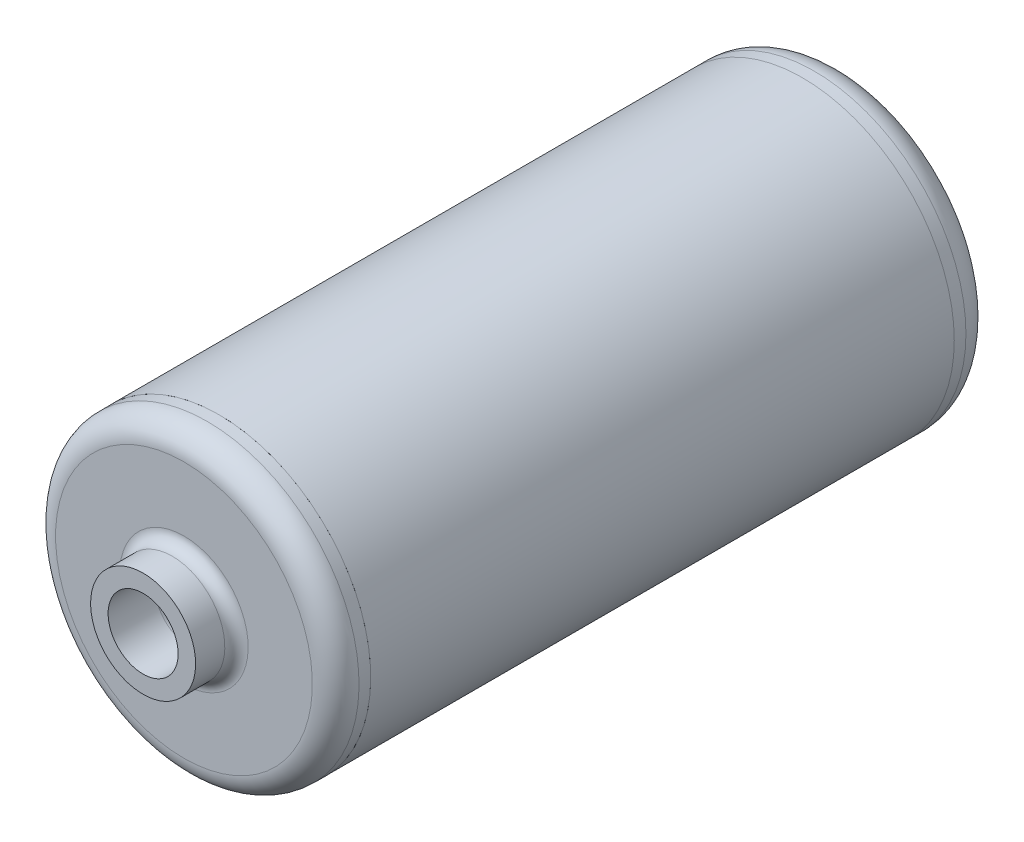
ISO-10303-21;
HEADER;
FILE_DESCRIPTION(('STEP AP214'),'2;1');
FILE_NAME('part.step','',(''),(''),'','','');
FILE_SCHEMA(('AUTOMOTIVE_DESIGN { 1 0 10303 214 1 1 1 1 }'));
ENDSEC;
DATA;
#1=APPLICATION_CONTEXT('core data for automotive mechanical design processes');
#2=APPLICATION_PROTOCOL_DEFINITION('international standard','automotive_design',2000,#1);
#3=PRODUCT_CONTEXT('',#1,'mechanical');
#4=PRODUCT('Part','Part','',(#3));
#5=PRODUCT_RELATED_PRODUCT_CATEGORY('part','',(#4));
#6=PRODUCT_DEFINITION_FORMATION('','',#4);
#7=PRODUCT_DEFINITION_CONTEXT('part definition',#1,'design');
#8=PRODUCT_DEFINITION('design','',#6,#7);
#9=PRODUCT_DEFINITION_SHAPE('','',#8);
#10=(LENGTH_UNIT() NAMED_UNIT(*) SI_UNIT(.MILLI.,.METRE.));
#11=(NAMED_UNIT(*) PLANE_ANGLE_UNIT() SI_UNIT($,.RADIAN.));
#12=(NAMED_UNIT(*) SI_UNIT($,.STERADIAN.) SOLID_ANGLE_UNIT());
#13=UNCERTAINTY_MEASURE_WITH_UNIT(LENGTH_MEASURE(1.E-05),#10,'distance_accuracy_value','');
#14=(GEOMETRIC_REPRESENTATION_CONTEXT(3) GLOBAL_UNCERTAINTY_ASSIGNED_CONTEXT((#13)) GLOBAL_UNIT_ASSIGNED_CONTEXT((#10,
#11,#12)) REPRESENTATION_CONTEXT('',''));
#15=CARTESIAN_POINT('',(0.,0.,0.));
#16=DIRECTION('',(0.,0.,1.));
#17=DIRECTION('',(1.,0.,0.));
#18=AXIS2_PLACEMENT_3D('',#15,#16,#17);
#19=CARTESIAN_POINT('',(0.,22.,-50.));
#20=DIRECTION('',(0.,0.,-1.));
#21=DIRECTION('',(-1.,0.,0.));
#22=AXIS2_PLACEMENT_3D('',#19,#20,#21);
#23=PLANE('',#22);
#24=CARTESIAN_POINT('',(0.,0.,-50.));
#25=DIRECTION('',(0.,0.,1.));
#26=DIRECTION('',(1.,0.,0.));
#27=AXIS2_PLACEMENT_3D('',#24,#25,#26);
#28=CIRCLE('',#27,22.);
#29=CARTESIAN_POINT('',(22.,0.,-50.));
#30=VERTEX_POINT('',#29);
#31=EDGE_CURVE('E77',#30,#30,#28,.T.);
#32=ORIENTED_EDGE('',*,*,#31,.F.);
#33=EDGE_LOOP('',(#32));
#34=FACE_BOUND('',#33,.T.);
#35=CARTESIAN_POINT('',(0.,0.,-50.));
#36=DIRECTION('',(0.,0.,1.));
#37=DIRECTION('',(1.,0.,0.));
#38=AXIS2_PLACEMENT_3D('',#35,#36,#37);
#39=CIRCLE('',#38,26.);
#40=CARTESIAN_POINT('',(26.,0.,-50.));
#41=VERTEX_POINT('',#40);
#42=EDGE_CURVE('E11',#41,#41,#39,.T.);
#43=ORIENTED_EDGE('',*,*,#42,.T.);
#44=EDGE_LOOP('',(#43));
#45=FACE_BOUND('',#44,.T.);
#46=ADVANCED_FACE('F43',(#34,#45),#23,.F.);
#47=CARTESIAN_POINT('',(0.,0.,0.));
#48=DIRECTION('',(0.,0.,1.));
#49=DIRECTION('',(1.,0.,0.));
#50=AXIS2_PLACEMENT_3D('',#47,#48,#49);
#51=CYLINDRICAL_SURFACE('',#50,26.);
#52=ORIENTED_EDGE('',*,*,#42,.F.);
#53=EDGE_LOOP('',(#52));
#54=FACE_BOUND('',#53,.T.);
#55=CARTESIAN_POINT('',(0.,0.,-52.));
#56=DIRECTION('',(0.,0.,1.));
#57=DIRECTION('',(1.,0.,0.));
#58=AXIS2_PLACEMENT_3D('',#55,#56,#57);
#59=CIRCLE('',#58,26.);
#60=CARTESIAN_POINT('',(26.,0.,-52.));
#61=VERTEX_POINT('',#60);
#62=EDGE_CURVE('E49',#61,#61,#59,.T.);
#63=ORIENTED_EDGE('',*,*,#62,.T.);
#64=EDGE_LOOP('',(#63));
#65=FACE_BOUND('',#64,.T.);
#66=ADVANCED_FACE('F84',(#54,#65),#51,.T.);
#67=CARTESIAN_POINT('',(0.,0.,-52.));
#68=DIRECTION('',(0.,0.,1.));
#69=DIRECTION('',(1.,0.,0.));
#70=AXIS2_PLACEMENT_3D('',#67,#68,#69);
#71=TOROIDAL_SURFACE('',#70,21.,5.);
#72=ORIENTED_EDGE('',*,*,#62,.F.);
#73=EDGE_LOOP('',(#72));
#74=FACE_BOUND('',#73,.T.);
#75=CARTESIAN_POINT('',(0.,0.,-57.));
#76=DIRECTION('',(0.,0.,1.));
#77=DIRECTION('',(1.,0.,0.));
#78=AXIS2_PLACEMENT_3D('',#75,#76,#77);
#79=CIRCLE('',#78,21.);
#80=CARTESIAN_POINT('',(21.,0.,-57.));
#81=VERTEX_POINT('',#80);
#82=EDGE_CURVE('E53',#81,#81,#79,.T.);
#83=ORIENTED_EDGE('',*,*,#82,.T.);
#84=EDGE_LOOP('',(#83));
#85=FACE_BOUND('',#84,.T.);
#86=ADVANCED_FACE('F88',(#74,#85),#71,.T.);
#87=CARTESIAN_POINT('',(0.,21.,-57.));
#88=DIRECTION('',(0.,0.,1.));
#89=DIRECTION('',(1.,0.,0.));
#90=AXIS2_PLACEMENT_3D('',#87,#88,#89);
#91=PLANE('',#90);
#92=ORIENTED_EDGE('',*,*,#82,.F.);
#93=EDGE_LOOP('',(#92));
#94=FACE_BOUND('',#93,.T.);
#95=CARTESIAN_POINT('',(0.,0.,-57.));
#96=DIRECTION('',(0.,0.,1.));
#97=DIRECTION('',(1.,0.,0.));
#98=AXIS2_PLACEMENT_3D('',#95,#96,#97);
#99=CIRCLE('',#98,8.00000000000001);
#100=CARTESIAN_POINT('',(8.00000000000001,0.,-57.));
#101=VERTEX_POINT('',#100);
#102=EDGE_CURVE('E57',#101,#101,#99,.T.);
#103=ORIENTED_EDGE('',*,*,#102,.T.);
#104=EDGE_LOOP('',(#103));
#105=FACE_BOUND('',#104,.T.);
#106=ADVANCED_FACE('F93',(#94,#105),#91,.F.);
#107=CARTESIAN_POINT('',(0.,0.,-55.));
#108=DIRECTION('',(0.,0.,1.));
#109=DIRECTION('',(1.,0.,0.));
#110=AXIS2_PLACEMENT_3D('',#107,#108,#109);
#111=TOROIDAL_SURFACE('',#110,8.,2.);
#112=ORIENTED_EDGE('',*,*,#102,.F.);
#113=EDGE_LOOP('',(#112));
#114=FACE_BOUND('',#113,.T.);
#115=CARTESIAN_POINT('',(0.,0.,-55.));
#116=DIRECTION('',(0.,0.,1.));
#117=DIRECTION('',(1.,0.,0.));
#118=AXIS2_PLACEMENT_3D('',#115,#116,#117);
#119=CIRCLE('',#118,6.);
#120=CARTESIAN_POINT('',(6.,0.,-55.));
#121=VERTEX_POINT('',#120);
#122=EDGE_CURVE('E62',#121,#121,#119,.T.);
#123=ORIENTED_EDGE('',*,*,#122,.T.);
#124=EDGE_LOOP('',(#123));
#125=FACE_BOUND('',#124,.T.);
#126=ADVANCED_FACE('F99',(#114,#125),#111,.T.);
#127=CARTESIAN_POINT('',(0.,0.,0.));
#128=DIRECTION('',(0.,0.,1.));
#129=DIRECTION('',(1.,0.,0.));
#130=AXIS2_PLACEMENT_3D('',#127,#128,#129);
#131=CYLINDRICAL_SURFACE('',#130,6.);
#132=ORIENTED_EDGE('',*,*,#122,.F.);
#133=EDGE_LOOP('',(#132));
#134=FACE_BOUND('',#133,.T.);
#135=CARTESIAN_POINT('',(0.,0.,-45.));
#136=DIRECTION('',(0.,0.,1.));
#137=DIRECTION('',(1.,0.,0.));
#138=AXIS2_PLACEMENT_3D('',#135,#136,#137);
#139=CIRCLE('',#138,6.);
#140=CARTESIAN_POINT('',(6.,0.,-45.));
#141=VERTEX_POINT('',#140);
#142=EDGE_CURVE('E65',#141,#141,#139,.T.);
#143=ORIENTED_EDGE('',*,*,#142,.T.);
#144=EDGE_LOOP('',(#143));
#145=FACE_BOUND('',#144,.T.);
#146=ADVANCED_FACE('F103',(#134,#145),#131,.F.);
#147=CARTESIAN_POINT('',(0.,0.,-45.));
#148=DIRECTION('',(0.,0.,1.));
#149=DIRECTION('',(1.,0.,0.));
#150=AXIS2_PLACEMENT_3D('',#147,#148,#149);
#151=TOROIDAL_SURFACE('',#150,8.,2.);
#152=ORIENTED_EDGE('',*,*,#142,.F.);
#153=EDGE_LOOP('',(#152));
#154=FACE_BOUND('',#153,.T.);
#155=CARTESIAN_POINT('',(0.,0.,-43.));
#156=DIRECTION('',(0.,0.,1.));
#157=DIRECTION('',(1.,0.,0.));
#158=AXIS2_PLACEMENT_3D('',#155,#156,#157);
#159=CIRCLE('',#158,8.00000000000001);
#160=CARTESIAN_POINT('',(8.00000000000001,0.,-43.));
#161=VERTEX_POINT('',#160);
#162=EDGE_CURVE('E68',#161,#161,#159,.T.);
#163=ORIENTED_EDGE('',*,*,#162,.T.);
#164=EDGE_LOOP('',(#163));
#165=FACE_BOUND('',#164,.T.);
#166=ADVANCED_FACE('F107',(#154,#165),#151,.T.);
#167=CARTESIAN_POINT('',(0.,8.00000000000001,-43.));
#168=DIRECTION('',(0.,0.,-1.));
#169=DIRECTION('',(-1.,0.,0.));
#170=AXIS2_PLACEMENT_3D('',#167,#168,#169);
#171=PLANE('',#170);
#172=ORIENTED_EDGE('',*,*,#162,.F.);
#173=EDGE_LOOP('',(#172));
#174=FACE_BOUND('',#173,.T.);
#175=CARTESIAN_POINT('',(0.,0.,-43.));
#176=DIRECTION('',(0.,0.,1.));
#177=DIRECTION('',(1.,0.,0.));
#178=AXIS2_PLACEMENT_3D('',#175,#176,#177);
#179=CIRCLE('',#178,20.);
#180=CARTESIAN_POINT('',(20.,0.,-43.));
#181=VERTEX_POINT('',#180);
#182=EDGE_CURVE('E71',#181,#181,#179,.T.);
#183=ORIENTED_EDGE('',*,*,#182,.T.);
#184=EDGE_LOOP('',(#183));
#185=FACE_BOUND('',#184,.T.);
#186=ADVANCED_FACE('F111',(#174,#185),#171,.F.);
#187=CARTESIAN_POINT('',(0.,0.,-45.));
#188=DIRECTION('',(0.,0.,1.));
#189=DIRECTION('',(1.,0.,0.));
#190=AXIS2_PLACEMENT_3D('',#187,#188,#189);
#191=TOROIDAL_SURFACE('',#190,20.,2.);
#192=ORIENTED_EDGE('',*,*,#182,.F.);
#193=EDGE_LOOP('',(#192));
#194=FACE_BOUND('',#193,.T.);
#195=CARTESIAN_POINT('',(0.,0.,-45.));
#196=DIRECTION('',(0.,0.,1.));
#197=DIRECTION('',(1.,0.,0.));
#198=AXIS2_PLACEMENT_3D('',#195,#196,#197);
#199=CIRCLE('',#198,22.);
#200=CARTESIAN_POINT('',(22.,0.,-45.));
#201=VERTEX_POINT('',#200);
#202=EDGE_CURVE('E74',#201,#201,#199,.T.);
#203=ORIENTED_EDGE('',*,*,#202,.T.);
#204=EDGE_LOOP('',(#203));
#205=FACE_BOUND('',#204,.T.);
#206=ADVANCED_FACE('F115',(#194,#205),#191,.T.);
#207=CARTESIAN_POINT('',(0.,0.,0.));
#208=DIRECTION('',(0.,0.,1.));
#209=DIRECTION('',(1.,0.,0.));
#210=AXIS2_PLACEMENT_3D('',#207,#208,#209);
#211=CYLINDRICAL_SURFACE('',#210,22.);
#212=ORIENTED_EDGE('',*,*,#202,.F.);
#213=EDGE_LOOP('',(#212));
#214=FACE_BOUND('',#213,.T.);
#215=ORIENTED_EDGE('',*,*,#31,.T.);
#216=EDGE_LOOP('',(#215));
#217=FACE_BOUND('',#216,.T.);
#218=ADVANCED_FACE('F81',(#214,#217),#211,.T.);
#219=CLOSED_SHELL('',(#46,#66,#86,#106,#126,#146,#166,#186,#206,#218));
#220=MANIFOLD_SOLID_BREP('B2',#219);
#221=CARTESIAN_POINT('',(0.,26.,50.));
#222=DIRECTION('',(0.,0.,-1.));
#223=DIRECTION('',(0.,1.,0.));
#224=AXIS2_PLACEMENT_3D('',#221,#222,#223);
#225=PLANE('',#224);
#226=CARTESIAN_POINT('',(0.,0.,50.));
#227=DIRECTION('',(0.,0.,-1.));
#228=DIRECTION('',(0.,1.,0.));
#229=AXIS2_PLACEMENT_3D('',#226,#227,#228);
#230=CIRCLE('',#229,26.);
#231=CARTESIAN_POINT('',(0.,26.,50.));
#232=VERTEX_POINT('',#231);
#233=EDGE_CURVE('E250',#232,#232,#230,.T.);
#234=ORIENTED_EDGE('',*,*,#233,.T.);
#235=EDGE_LOOP('',(#234));
#236=FACE_BOUND('',#235,.T.);
#237=CARTESIAN_POINT('',(0.,0.,50.));
#238=DIRECTION('',(0.,0.,-1.));
#239=DIRECTION('',(0.,1.,0.));
#240=AXIS2_PLACEMENT_3D('',#237,#238,#239);
#241=CIRCLE('',#240,22.);
#242=CARTESIAN_POINT('',(0.,22.,50.));
#243=VERTEX_POINT('',#242);
#244=EDGE_CURVE('E42',#243,#243,#241,.T.);
#245=ORIENTED_EDGE('',*,*,#244,.F.);
#246=EDGE_LOOP('',(#245));
#247=FACE_BOUND('',#246,.T.);
#248=ADVANCED_FACE('F201',(#236,#247),#225,.T.);
#249=CARTESIAN_POINT('',(0.,0.,-65.9873244020304));
#250=DIRECTION('',(0.,0.,-1.));
#251=DIRECTION('',(0.,1.,0.));
#252=AXIS2_PLACEMENT_3D('',#249,#250,#251);
#253=CYLINDRICAL_SURFACE('',#252,22.);
#254=ORIENTED_EDGE('',*,*,#244,.T.);
#255=EDGE_LOOP('',(#254));
#256=FACE_BOUND('',#255,.T.);
#257=CARTESIAN_POINT('',(0.,0.,43.));
#258=DIRECTION('',(0.,0.,-1.));
#259=DIRECTION('',(0.,1.,0.));
#260=AXIS2_PLACEMENT_3D('',#257,#258,#259);
#261=CIRCLE('',#260,22.);
#262=CARTESIAN_POINT('',(0.,22.,43.));
#263=VERTEX_POINT('',#262);
#264=EDGE_CURVE('E207',#263,#263,#261,.T.);
#265=ORIENTED_EDGE('',*,*,#264,.F.);
#266=EDGE_LOOP('',(#265));
#267=FACE_BOUND('',#266,.T.);
#268=ADVANCED_FACE('F268',(#256,#267),#253,.T.);
#269=CARTESIAN_POINT('',(0.,22.,43.));
#270=DIRECTION('',(0.,0.,-1.));
#271=DIRECTION('',(0.,1.,0.));
#272=AXIS2_PLACEMENT_3D('',#269,#270,#271);
#273=PLANE('',#272);
#274=ORIENTED_EDGE('',*,*,#264,.T.);
#275=EDGE_LOOP('',(#274));
#276=FACE_BOUND('',#275,.T.);
#277=CARTESIAN_POINT('',(0.,0.,43.));
#278=DIRECTION('',(0.,0.,-1.));
#279=DIRECTION('',(0.,1.,0.));
#280=AXIS2_PLACEMENT_3D('',#277,#278,#279);
#281=CIRCLE('',#280,21.);
#282=CARTESIAN_POINT('',(0.,21.,43.));
#283=VERTEX_POINT('',#282);
#284=EDGE_CURVE('E211',#283,#283,#281,.T.);
#285=ORIENTED_EDGE('',*,*,#284,.F.);
#286=EDGE_LOOP('',(#285));
#287=FACE_BOUND('',#286,.T.);
#288=ADVANCED_FACE('F272',(#276,#287),#273,.T.);
#289=CARTESIAN_POINT('',(0.,0.,45.));
#290=DIRECTION('',(0.,0.,-1.));
#291=DIRECTION('',(0.,1.,0.));
#292=AXIS2_PLACEMENT_3D('',#289,#290,#291);
#293=TOROIDAL_SURFACE('',#292,21.,2.);
#294=ORIENTED_EDGE('',*,*,#284,.T.);
#295=EDGE_LOOP('',(#294));
#296=FACE_BOUND('',#295,.T.);
#297=CARTESIAN_POINT('',(0.,0.,45.));
#298=DIRECTION('',(0.,0.,-1.));
#299=DIRECTION('',(0.,1.,0.));
#300=AXIS2_PLACEMENT_3D('',#297,#298,#299);
#301=CIRCLE('',#300,19.);
#302=CARTESIAN_POINT('',(0.,19.,45.));
#303=VERTEX_POINT('',#302);
#304=EDGE_CURVE('E215',#303,#303,#301,.T.);
#305=ORIENTED_EDGE('',*,*,#304,.F.);
#306=EDGE_LOOP('',(#305));
#307=FACE_BOUND('',#306,.T.);
#308=ADVANCED_FACE('F276',(#296,#307),#293,.T.);
#309=CARTESIAN_POINT('',(0.,0.,-65.9873244020304));
#310=DIRECTION('',(0.,0.,-1.));
#311=DIRECTION('',(0.,1.,0.));
#312=AXIS2_PLACEMENT_3D('',#309,#310,#311);
#313=CYLINDRICAL_SURFACE('',#312,19.);
#314=ORIENTED_EDGE('',*,*,#304,.T.);
#315=EDGE_LOOP('',(#314));
#316=FACE_BOUND('',#315,.T.);
#317=CARTESIAN_POINT('',(0.,0.,49.));
#318=DIRECTION('',(0.,0.,-1.));
#319=DIRECTION('',(0.,1.,0.));
#320=AXIS2_PLACEMENT_3D('',#317,#318,#319);
#321=CIRCLE('',#320,19.);
#322=CARTESIAN_POINT('',(0.,19.,49.));
#323=VERTEX_POINT('',#322);
#324=EDGE_CURVE('E220',#323,#323,#321,.T.);
#325=ORIENTED_EDGE('',*,*,#324,.F.);
#326=EDGE_LOOP('',(#325));
#327=FACE_BOUND('',#326,.T.);
#328=ADVANCED_FACE('F282',(#316,#327),#313,.F.);
#329=CARTESIAN_POINT('',(0.,0.,49.));
#330=DIRECTION('',(0.,0.,-1.));
#331=DIRECTION('',(0.,1.,0.));
#332=AXIS2_PLACEMENT_3D('',#329,#330,#331);
#333=TOROIDAL_SURFACE('',#332,15.,4.);
#334=ORIENTED_EDGE('',*,*,#324,.T.);
#335=EDGE_LOOP('',(#334));
#336=FACE_BOUND('',#335,.T.);
#337=CARTESIAN_POINT('',(0.,0.,53.));
#338=DIRECTION('',(0.,0.,-1.));
#339=DIRECTION('',(0.,1.,0.));
#340=AXIS2_PLACEMENT_3D('',#337,#338,#339);
#341=CIRCLE('',#340,15.);
#342=CARTESIAN_POINT('',(0.,15.,53.));
#343=VERTEX_POINT('',#342);
#344=EDGE_CURVE('E223',#343,#343,#341,.T.);
#345=ORIENTED_EDGE('',*,*,#344,.F.);
#346=EDGE_LOOP('',(#345));
#347=FACE_BOUND('',#346,.T.);
#348=ADVANCED_FACE('F286',(#336,#347),#333,.F.);
#349=CARTESIAN_POINT('',(0.,15.,53.));
#350=DIRECTION('',(0.,0.,-1.));
#351=DIRECTION('',(0.,1.,0.));
#352=AXIS2_PLACEMENT_3D('',#349,#350,#351);
#353=PLANE('',#352);
#354=ORIENTED_EDGE('',*,*,#344,.T.);
#355=EDGE_LOOP('',(#354));
#356=FACE_BOUND('',#355,.T.);
#357=CARTESIAN_POINT('',(0.,0.,53.));
#358=DIRECTION('',(0.,0.,-1.));
#359=DIRECTION('',(0.,1.,0.));
#360=AXIS2_PLACEMENT_3D('',#357,#358,#359);
#361=CIRCLE('',#360,8.00000000000001);
#362=CARTESIAN_POINT('',(0.,8.,53.));
#363=VERTEX_POINT('',#362);
#364=EDGE_CURVE('E226',#363,#363,#361,.T.);
#365=ORIENTED_EDGE('',*,*,#364,.F.);
#366=EDGE_LOOP('',(#365));
#367=FACE_BOUND('',#366,.T.);
#368=ADVANCED_FACE('F290',(#356,#367),#353,.T.);
#369=CARTESIAN_POINT('',(0.,0.,55.));
#370=DIRECTION('',(0.,0.,-1.));
#371=DIRECTION('',(0.,1.,0.));
#372=AXIS2_PLACEMENT_3D('',#369,#370,#371);
#373=TOROIDAL_SURFACE('',#372,8.,2.);
#374=ORIENTED_EDGE('',*,*,#364,.T.);
#375=EDGE_LOOP('',(#374));
#376=FACE_BOUND('',#375,.T.);
#377=CARTESIAN_POINT('',(0.,0.,55.));
#378=DIRECTION('',(0.,0.,-1.));
#379=DIRECTION('',(0.,1.,0.));
#380=AXIS2_PLACEMENT_3D('',#377,#378,#379);
#381=CIRCLE('',#380,6.);
#382=CARTESIAN_POINT('',(0.,5.99999999999999,55.));
#383=VERTEX_POINT('',#382);
#384=EDGE_CURVE('E229',#383,#383,#381,.T.);
#385=ORIENTED_EDGE('',*,*,#384,.F.);
#386=EDGE_LOOP('',(#385));
#387=FACE_BOUND('',#386,.T.);
#388=ADVANCED_FACE('F294',(#376,#387),#373,.T.);
#389=CARTESIAN_POINT('',(0.,0.,-65.9873244020304));
#390=DIRECTION('',(0.,0.,-1.));
#391=DIRECTION('',(0.,1.,0.));
#392=AXIS2_PLACEMENT_3D('',#389,#390,#391);
#393=CYLINDRICAL_SURFACE('',#392,6.);
#394=ORIENTED_EDGE('',*,*,#384,.T.);
#395=EDGE_LOOP('',(#394));
#396=FACE_BOUND('',#395,.T.);
#397=CARTESIAN_POINT('',(0.,0.,63.));
#398=DIRECTION('',(0.,0.,-1.));
#399=DIRECTION('',(0.,1.,0.));
#400=AXIS2_PLACEMENT_3D('',#397,#398,#399);
#401=CIRCLE('',#400,6.);
#402=CARTESIAN_POINT('',(0.,5.99999999999998,63.));
#403=VERTEX_POINT('',#402);
#404=EDGE_CURVE('E232',#403,#403,#401,.T.);
#405=ORIENTED_EDGE('',*,*,#404,.F.);
#406=EDGE_LOOP('',(#405));
#407=FACE_BOUND('',#406,.T.);
#408=ADVANCED_FACE('F298',(#396,#407),#393,.F.);
#409=CARTESIAN_POINT('',(0.,5.99999999999998,63.));
#410=DIRECTION('',(0.,0.,1.));
#411=DIRECTION('',(0.,-1.,0.));
#412=AXIS2_PLACEMENT_3D('',#409,#410,#411);
#413=PLANE('',#412);
#414=ORIENTED_EDGE('',*,*,#404,.T.);
#415=EDGE_LOOP('',(#414));
#416=FACE_BOUND('',#415,.T.);
#417=CARTESIAN_POINT('',(0.,0.,63.));
#418=DIRECTION('',(0.,0.,-1.));
#419=DIRECTION('',(0.,1.,0.));
#420=AXIS2_PLACEMENT_3D('',#417,#418,#419);
#421=CIRCLE('',#420,9.);
#422=CARTESIAN_POINT('',(0.,8.99999999999998,63.));
#423=VERTEX_POINT('',#422);
#424=EDGE_CURVE('E235',#423,#423,#421,.T.);
#425=ORIENTED_EDGE('',*,*,#424,.F.);
#426=EDGE_LOOP('',(#425));
#427=FACE_BOUND('',#426,.T.);
#428=ADVANCED_FACE('F302',(#416,#427),#413,.T.);
#429=CARTESIAN_POINT('',(0.,0.,-65.9873244020304));
#430=DIRECTION('',(0.,0.,-1.));
#431=DIRECTION('',(0.,1.,0.));
#432=AXIS2_PLACEMENT_3D('',#429,#430,#431);
#433=CYLINDRICAL_SURFACE('',#432,9.);
#434=ORIENTED_EDGE('',*,*,#424,.T.);
#435=EDGE_LOOP('',(#434));
#436=FACE_BOUND('',#435,.T.);
#437=CARTESIAN_POINT('',(0.,0.,58.));
#438=DIRECTION('',(0.,0.,-1.));
#439=DIRECTION('',(0.,1.,0.));
#440=AXIS2_PLACEMENT_3D('',#437,#438,#439);
#441=CIRCLE('',#440,9.);
#442=CARTESIAN_POINT('',(0.,8.99999999999998,58.));
#443=VERTEX_POINT('',#442);
#444=EDGE_CURVE('E238',#443,#443,#441,.T.);
#445=ORIENTED_EDGE('',*,*,#444,.F.);
#446=EDGE_LOOP('',(#445));
#447=FACE_BOUND('',#446,.T.);
#448=ADVANCED_FACE('F306',(#436,#447),#433,.T.);
#449=CARTESIAN_POINT('',(0.,0.,58.));
#450=DIRECTION('',(0.,0.,-1.));
#451=DIRECTION('',(0.,1.,0.));
#452=AXIS2_PLACEMENT_3D('',#449,#450,#451);
#453=TOROIDAL_SURFACE('',#452,11.,2.);
#454=ORIENTED_EDGE('',*,*,#444,.T.);
#455=EDGE_LOOP('',(#454));
#456=FACE_BOUND('',#455,.T.);
#457=CARTESIAN_POINT('',(0.,0.,56.));
#458=DIRECTION('',(0.,0.,-1.));
#459=DIRECTION('',(0.,1.,0.));
#460=AXIS2_PLACEMENT_3D('',#457,#458,#459);
#461=CIRCLE('',#460,11.);
#462=CARTESIAN_POINT('',(0.,11.,56.));
#463=VERTEX_POINT('',#462);
#464=EDGE_CURVE('E241',#463,#463,#461,.T.);
#465=ORIENTED_EDGE('',*,*,#464,.F.);
#466=EDGE_LOOP('',(#465));
#467=FACE_BOUND('',#466,.T.);
#468=ADVANCED_FACE('F310',(#456,#467),#453,.F.);
#469=CARTESIAN_POINT('',(0.,11.,56.));
#470=DIRECTION('',(0.,0.,1.));
#471=DIRECTION('',(0.,-1.,0.));
#472=AXIS2_PLACEMENT_3D('',#469,#470,#471);
#473=PLANE('',#472);
#474=ORIENTED_EDGE('',*,*,#464,.T.);
#475=EDGE_LOOP('',(#474));
#476=FACE_BOUND('',#475,.T.);
#477=CARTESIAN_POINT('',(0.,0.,56.));
#478=DIRECTION('',(0.,0.,-1.));
#479=DIRECTION('',(0.,1.,0.));
#480=AXIS2_PLACEMENT_3D('',#477,#478,#479);
#481=CIRCLE('',#480,22.);
#482=CARTESIAN_POINT('',(0.,22.,56.));
#483=VERTEX_POINT('',#482);
#484=EDGE_CURVE('E244',#483,#483,#481,.T.);
#485=ORIENTED_EDGE('',*,*,#484,.F.);
#486=EDGE_LOOP('',(#485));
#487=FACE_BOUND('',#486,.T.);
#488=ADVANCED_FACE('F264',(#476,#487),#473,.T.);
#489=CARTESIAN_POINT('',(0.,0.,52.));
#490=DIRECTION('',(0.,0.,-1.));
#491=DIRECTION('',(0.,1.,0.));
#492=AXIS2_PLACEMENT_3D('',#489,#490,#491);
#493=TOROIDAL_SURFACE('',#492,22.,4.);
#494=ORIENTED_EDGE('',*,*,#484,.T.);
#495=EDGE_LOOP('',(#494));
#496=FACE_BOUND('',#495,.T.);
#497=CARTESIAN_POINT('',(0.,0.,52.));
#498=DIRECTION('',(0.,0.,-1.));
#499=DIRECTION('',(0.,1.,0.));
#500=AXIS2_PLACEMENT_3D('',#497,#498,#499);
#501=CIRCLE('',#500,26.);
#502=CARTESIAN_POINT('',(0.,26.,52.));
#503=VERTEX_POINT('',#502);
#504=EDGE_CURVE('E247',#503,#503,#501,.T.);
#505=ORIENTED_EDGE('',*,*,#504,.F.);
#506=EDGE_LOOP('',(#505));
#507=FACE_BOUND('',#506,.T.);
#508=ADVANCED_FACE('F258',(#496,#507),#493,.T.);
#509=CARTESIAN_POINT('',(0.,0.,-65.9873244020304));
#510=DIRECTION('',(0.,0.,-1.));
#511=DIRECTION('',(0.,1.,0.));
#512=AXIS2_PLACEMENT_3D('',#509,#510,#511);
#513=CYLINDRICAL_SURFACE('',#512,26.);
#514=ORIENTED_EDGE('',*,*,#504,.T.);
#515=EDGE_LOOP('',(#514));
#516=FACE_BOUND('',#515,.T.);
#517=ORIENTED_EDGE('',*,*,#233,.F.);
#518=EDGE_LOOP('',(#517));
#519=FACE_BOUND('',#518,.T.);
#520=ADVANCED_FACE('F256',(#516,#519),#513,.T.);
#521=CLOSED_SHELL('',(#248,#268,#288,#308,#328,#348,#368,#388,#408,#428,#448,#468,#488,#508,#520));
#522=MANIFOLD_SOLID_BREP('B6',#521);
#523=CARTESIAN_POINT('',(0.,0.,-50.));
#524=DIRECTION('',(0.,0.,1.));
#525=DIRECTION('',(1.,0.,0.));
#526=AXIS2_PLACEMENT_3D('',#523,#524,#525);
#527=CYLINDRICAL_SURFACE('',#526,26.);
#528=CARTESIAN_POINT('',(0.,0.,-50.));
#529=DIRECTION('',(0.,0.,1.));
#530=DIRECTION('',(1.,0.,0.));
#531=AXIS2_PLACEMENT_3D('',#528,#529,#530);
#532=CIRCLE('',#531,26.);
#533=CARTESIAN_POINT('',(26.,0.,-50.));
#534=VERTEX_POINT('',#533);
#535=EDGE_CURVE('E200',#534,#534,#532,.T.);
#536=ORIENTED_EDGE('',*,*,#535,.T.);
#537=EDGE_LOOP('',(#536));
#538=FACE_BOUND('',#537,.T.);
#539=CARTESIAN_POINT('',(0.,0.,50.));
#540=DIRECTION('',(0.,0.,1.));
#541=DIRECTION('',(1.,0.,0.));
#542=AXIS2_PLACEMENT_3D('',#539,#540,#541);
#543=CIRCLE('',#542,26.);
#544=CARTESIAN_POINT('',(26.,0.,50.));
#545=VERTEX_POINT('',#544);
#546=EDGE_CURVE('E437',#545,#545,#543,.T.);
#547=ORIENTED_EDGE('',*,*,#546,.F.);
#548=EDGE_LOOP('',(#547));
#549=FACE_BOUND('',#548,.T.);
#550=ADVANCED_FACE('F427',(#538,#549),#527,.T.);
#551=CARTESIAN_POINT('',(0.,0.,-50.));
#552=DIRECTION('',(0.,0.,1.));
#553=DIRECTION('',(1.,0.,0.));
#554=AXIS2_PLACEMENT_3D('',#551,#552,#553);
#555=PLANE('',#554);
#556=CARTESIAN_POINT('',(0.,0.,-50.));
#557=DIRECTION('',(0.,0.,1.));
#558=DIRECTION('',(1.,0.,0.));
#559=AXIS2_PLACEMENT_3D('',#556,#557,#558);
#560=CIRCLE('',#559,22.);
#561=CARTESIAN_POINT('',(22.,0.,-50.));
#562=VERTEX_POINT('',#561);
#563=EDGE_CURVE('E433',#562,#562,#560,.T.);
#564=ORIENTED_EDGE('',*,*,#563,.T.);
#565=EDGE_LOOP('',(#564));
#566=FACE_BOUND('',#565,.T.);
#567=ORIENTED_EDGE('',*,*,#535,.F.);
#568=EDGE_LOOP('',(#567));
#569=FACE_BOUND('',#568,.T.);
#570=ADVANCED_FACE('F456',(#566,#569),#555,.F.);
#571=CARTESIAN_POINT('',(0.,0.,-50.));
#572=DIRECTION('',(0.,0.,1.));
#573=DIRECTION('',(1.,0.,0.));
#574=AXIS2_PLACEMENT_3D('',#571,#572,#573);
#575=CYLINDRICAL_SURFACE('',#574,22.);
#576=ORIENTED_EDGE('',*,*,#563,.F.);
#577=EDGE_LOOP('',(#576));
#578=FACE_BOUND('',#577,.T.);
#579=CARTESIAN_POINT('',(0.,0.,50.));
#580=DIRECTION('',(0.,0.,1.));
#581=DIRECTION('',(1.,0.,0.));
#582=AXIS2_PLACEMENT_3D('',#579,#580,#581);
#583=CIRCLE('',#582,22.);
#584=CARTESIAN_POINT('',(22.,0.,50.));
#585=VERTEX_POINT('',#584);
#586=EDGE_CURVE('E441',#585,#585,#583,.T.);
#587=ORIENTED_EDGE('',*,*,#586,.T.);
#588=EDGE_LOOP('',(#587));
#589=FACE_BOUND('',#588,.T.);
#590=ADVANCED_FACE('F447',(#578,#589),#575,.F.);
#591=CARTESIAN_POINT('',(0.,0.,50.));
#592=DIRECTION('',(0.,0.,1.));
#593=DIRECTION('',(1.,0.,0.));
#594=AXIS2_PLACEMENT_3D('',#591,#592,#593);
#595=PLANE('',#594);
#596=ORIENTED_EDGE('',*,*,#546,.T.);
#597=EDGE_LOOP('',(#596));
#598=FACE_BOUND('',#597,.T.);
#599=ORIENTED_EDGE('',*,*,#586,.F.);
#600=EDGE_LOOP('',(#599));
#601=FACE_BOUND('',#600,.T.);
#602=ADVANCED_FACE('F449',(#598,#601),#595,.T.);
#603=CLOSED_SHELL('',(#550,#570,#590,#602));
#604=MANIFOLD_SOLID_BREP('B37',#603);
#605=ADVANCED_BREP_SHAPE_REPRESENTATION('',(#18,#220,#522,#604),#14);
#606=SHAPE_DEFINITION_REPRESENTATION(#9,#605);
ENDSEC;
END-ISO-10303-21;
